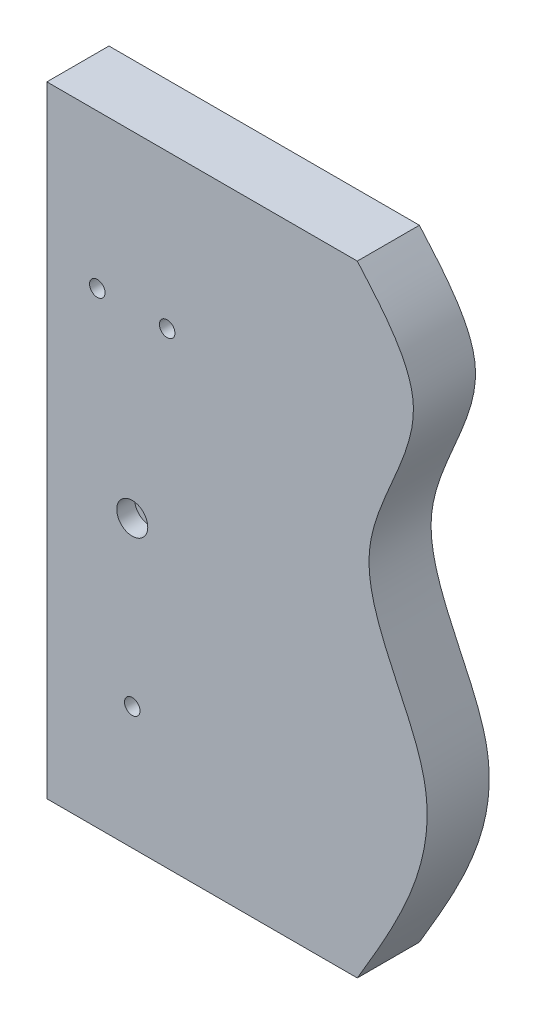
ISO-10303-21;
HEADER;
FILE_DESCRIPTION(('STEP AP214'),'2;1');
FILE_NAME('part.step','',(''),(''),'','','');
FILE_SCHEMA(('AUTOMOTIVE_DESIGN { 1 0 10303 214 1 1 1 1 }'));
ENDSEC;
DATA;
#1=APPLICATION_CONTEXT('core data for automotive mechanical design processes');
#2=APPLICATION_PROTOCOL_DEFINITION('international standard','automotive_design',2000,#1);
#3=PRODUCT_CONTEXT('',#1,'mechanical');
#4=PRODUCT('Part','Part','',(#3));
#5=PRODUCT_RELATED_PRODUCT_CATEGORY('part','',(#4));
#6=PRODUCT_DEFINITION_FORMATION('','',#4);
#7=PRODUCT_DEFINITION_CONTEXT('part definition',#1,'design');
#8=PRODUCT_DEFINITION('design','',#6,#7);
#9=PRODUCT_DEFINITION_SHAPE('','',#8);
#10=(LENGTH_UNIT() NAMED_UNIT(*) SI_UNIT(.MILLI.,.METRE.));
#11=(NAMED_UNIT(*) PLANE_ANGLE_UNIT() SI_UNIT($,.RADIAN.));
#12=(NAMED_UNIT(*) SI_UNIT($,.STERADIAN.) SOLID_ANGLE_UNIT());
#13=UNCERTAINTY_MEASURE_WITH_UNIT(LENGTH_MEASURE(1.E-05),#10,'distance_accuracy_value','');
#14=(GEOMETRIC_REPRESENTATION_CONTEXT(3) GLOBAL_UNCERTAINTY_ASSIGNED_CONTEXT((#13)) GLOBAL_UNIT_ASSIGNED_CONTEXT((#10,
#11,#12)) REPRESENTATION_CONTEXT('',''));
#15=CARTESIAN_POINT('',(0.,0.,0.));
#16=DIRECTION('',(0.,0.,1.));
#17=DIRECTION('',(1.,0.,0.));
#18=AXIS2_PLACEMENT_3D('',#15,#16,#17);
#19=CARTESIAN_POINT('',(-147.,-116.5,-8.5));
#20=DIRECTION('',(0.,-1.,0.));
#21=DIRECTION('',(1.,0.,0.));
#22=AXIS2_PLACEMENT_3D('',#19,#20,#21);
#23=PLANE('',#22);
#24=DIRECTION('',(1.,0.,0.));
#25=VECTOR('',#24,1.);
#26=CARTESIAN_POINT('',(-147.,-116.5,-8.5));
#27=LINE('',#26,#25);
#28=CARTESIAN_POINT('',(-92.8205505282296,-116.5,-8.5));
#29=VERTEX_POINT('',#28);
#30=CARTESIAN_POINT('',(-70.,-116.5,-8.5));
#31=VERTEX_POINT('',#30);
#32=EDGE_CURVE('E141',#29,#31,#27,.T.);
#33=ORIENTED_EDGE('',*,*,#32,.F.);
#34=DIRECTION('',(0.,0.,1.));
#35=VECTOR('',#34,1.);
#36=CARTESIAN_POINT('',(-92.8205505282296,-116.5,-20.));
#37=LINE('',#36,#35);
#38=CARTESIAN_POINT('',(-92.8205505282296,-116.5,8.5));
#39=VERTEX_POINT('',#38);
#40=EDGE_CURVE('E133',#29,#39,#37,.T.);
#41=ORIENTED_EDGE('',*,*,#40,.T.);
#42=DIRECTION('',(1.,0.,0.));
#43=VECTOR('',#42,1.);
#44=CARTESIAN_POINT('',(-147.,-116.5,8.5));
#45=LINE('',#44,#43);
#46=CARTESIAN_POINT('',(-70.,-116.5,8.5));
#47=VERTEX_POINT('',#46);
#48=EDGE_CURVE('E139',#39,#47,#45,.T.);
#49=ORIENTED_EDGE('',*,*,#48,.T.);
#50=DIRECTION('',(0.,0.,1.));
#51=VECTOR('',#50,1.);
#52=CARTESIAN_POINT('',(-70.,-116.5,-8.5));
#53=LINE('',#52,#51);
#54=EDGE_CURVE('E172',#31,#47,#53,.T.);
#55=ORIENTED_EDGE('',*,*,#54,.F.);
#56=EDGE_LOOP('',(#33,#41,#49,#55));
#57=FACE_BOUND('',#56,.T.);
#58=ADVANCED_FACE('F32',(#57),#23,.F.);
#59=CARTESIAN_POINT('',(-147.,-150.,-11.));
#60=DIRECTION('',(-1.,0.,0.));
#61=DIRECTION('',(0.,0.,1.));
#62=AXIS2_PLACEMENT_3D('',#59,#60,#61);
#63=PLANE('',#62);
#64=DIRECTION('',(0.,-1.,0.));
#65=VECTOR('',#64,1.);
#66=CARTESIAN_POINT('',(-147.,80.,-11.));
#67=LINE('',#66,#65);
#68=CARTESIAN_POINT('',(-147.,80.,-11.));
#69=VERTEX_POINT('',#68);
#70=CARTESIAN_POINT('',(-147.,-150.,-11.));
#71=VERTEX_POINT('',#70);
#72=EDGE_CURVE('E174',#69,#71,#67,.T.);
#73=ORIENTED_EDGE('',*,*,#72,.T.);
#74=DIRECTION('',(0.,0.,1.));
#75=VECTOR('',#74,1.);
#76=CARTESIAN_POINT('',(-147.,-150.,-11.));
#77=LINE('',#76,#75);
#78=CARTESIAN_POINT('',(-147.,-150.,11.));
#79=VERTEX_POINT('',#78);
#80=EDGE_CURVE('E177',#71,#79,#77,.T.);
#81=ORIENTED_EDGE('',*,*,#80,.T.);
#82=DIRECTION('',(0.,1.,0.));
#83=VECTOR('',#82,1.);
#84=CARTESIAN_POINT('',(-147.,80.,11.));
#85=LINE('',#84,#83);
#86=CARTESIAN_POINT('',(-147.,80.,11.));
#87=VERTEX_POINT('',#86);
#88=EDGE_CURVE('E181',#79,#87,#85,.T.);
#89=ORIENTED_EDGE('',*,*,#88,.T.);
#90=DIRECTION('',(0.,0.,-1.));
#91=VECTOR('',#90,1.);
#92=CARTESIAN_POINT('',(-147.,80.,-11.));
#93=LINE('',#92,#91);
#94=EDGE_CURVE('E184',#87,#69,#93,.T.);
#95=ORIENTED_EDGE('',*,*,#94,.T.);
#96=EDGE_LOOP('',(#73,#81,#89,#95));
#97=FACE_BOUND('',#96,.T.);
#98=DIRECTION('',(0.,0.,1.));
#99=VECTOR('',#98,1.);
#100=CARTESIAN_POINT('',(-147.,-116.5,-8.5));
#101=LINE('',#100,#99);
#102=CARTESIAN_POINT('',(-147.,-116.5,-8.5));
#103=VERTEX_POINT('',#102);
#104=CARTESIAN_POINT('',(-147.,-116.5,8.5));
#105=VERTEX_POINT('',#104);
#106=EDGE_CURVE('E164',#103,#105,#101,.T.);
#107=ORIENTED_EDGE('',*,*,#106,.F.);
#108=DIRECTION('',(0.,-1.,0.));
#109=VECTOR('',#108,1.);
#110=CARTESIAN_POINT('',(-147.,-116.5,-8.5));
#111=LINE('',#110,#109);
#112=CARTESIAN_POINT('',(-147.,46.5,-8.5));
#113=VERTEX_POINT('',#112);
#114=EDGE_CURVE('E156',#113,#103,#111,.T.);
#115=ORIENTED_EDGE('',*,*,#114,.F.);
#116=DIRECTION('',(0.,0.,1.));
#117=VECTOR('',#116,1.);
#118=CARTESIAN_POINT('',(-147.,46.5,-8.5));
#119=LINE('',#118,#117);
#120=CARTESIAN_POINT('',(-147.,46.5,8.5));
#121=VERTEX_POINT('',#120);
#122=EDGE_CURVE('E167',#113,#121,#119,.T.);
#123=ORIENTED_EDGE('',*,*,#122,.T.);
#124=DIRECTION('',(0.,-1.,0.));
#125=VECTOR('',#124,1.);
#126=CARTESIAN_POINT('',(-147.,-116.5,8.5));
#127=LINE('',#126,#125);
#128=EDGE_CURVE('E161',#121,#105,#127,.T.);
#129=ORIENTED_EDGE('',*,*,#128,.T.);
#130=EDGE_LOOP('',(#107,#115,#123,#129));
#131=FACE_BOUND('',#130,.T.);
#132=ADVANCED_FACE('F235',(#97,#131),#63,.T.);
#133=CARTESIAN_POINT('',(-150.,200.,20.));
#134=DIRECTION('',(1.,0.,0.));
#135=DIRECTION('',(0.,0.,-1.));
#136=AXIS2_PLACEMENT_3D('',#133,#134,#135);
#137=PLANE('',#136);
#138=DIRECTION('',(0.,0.,1.));
#139=VECTOR('',#138,1.);
#140=CARTESIAN_POINT('',(-150.,-150.,-11.));
#141=LINE('',#140,#139);
#142=CARTESIAN_POINT('',(-150.,-150.,-11.));
#143=VERTEX_POINT('',#142);
#144=CARTESIAN_POINT('',(-150.,-150.,11.));
#145=VERTEX_POINT('',#144);
#146=EDGE_CURVE('E189',#143,#145,#141,.T.);
#147=ORIENTED_EDGE('',*,*,#146,.F.);
#148=DIRECTION('',(0.,-1.,0.));
#149=VECTOR('',#148,1.);
#150=CARTESIAN_POINT('',(-150.,80.,-11.));
#151=LINE('',#150,#149);
#152=CARTESIAN_POINT('',(-150.,80.,-11.));
#153=VERTEX_POINT('',#152);
#154=EDGE_CURVE('E166',#153,#143,#151,.T.);
#155=ORIENTED_EDGE('',*,*,#154,.F.);
#156=DIRECTION('',(0.,0.,-1.));
#157=VECTOR('',#156,1.);
#158=CARTESIAN_POINT('',(-150.,80.,-11.));
#159=LINE('',#158,#157);
#160=CARTESIAN_POINT('',(-150.,80.,11.));
#161=VERTEX_POINT('',#160);
#162=EDGE_CURVE('E178',#161,#153,#159,.T.);
#163=ORIENTED_EDGE('',*,*,#162,.F.);
#164=DIRECTION('',(0.,1.,0.));
#165=VECTOR('',#164,1.);
#166=CARTESIAN_POINT('',(-150.,80.,11.));
#167=LINE('',#166,#165);
#168=EDGE_CURVE('E192',#145,#161,#167,.T.);
#169=ORIENTED_EDGE('',*,*,#168,.F.);
#170=EDGE_LOOP('',(#147,#155,#163,#169));
#171=FACE_BOUND('',#170,.T.);
#172=DIRECTION('',(0.,-1.,0.));
#173=VECTOR('',#172,1.);
#174=CARTESIAN_POINT('',(-150.,200.,-20.));
#175=LINE('',#174,#173);
#176=CARTESIAN_POINT('',(-150.,200.,-20.));
#177=VERTEX_POINT('',#176);
#178=CARTESIAN_POINT('',(-150.,-200.,-20.));
#179=VERTEX_POINT('',#178);
#180=EDGE_CURVE('E199',#177,#179,#175,.T.);
#181=ORIENTED_EDGE('',*,*,#180,.T.);
#182=DIRECTION('',(0.,0.,-1.));
#183=VECTOR('',#182,1.);
#184=CARTESIAN_POINT('',(-150.,-200.,20.));
#185=LINE('',#184,#183);
#186=CARTESIAN_POINT('',(-150.,-200.,20.));
#187=VERTEX_POINT('',#186);
#188=EDGE_CURVE('E40',#187,#179,#185,.T.);
#189=ORIENTED_EDGE('',*,*,#188,.F.);
#190=DIRECTION('',(0.,-1.,0.));
#191=VECTOR('',#190,1.);
#192=CARTESIAN_POINT('',(-150.,200.,20.));
#193=LINE('',#192,#191);
#194=CARTESIAN_POINT('',(-150.,200.,20.));
#195=VERTEX_POINT('',#194);
#196=EDGE_CURVE('E206',#195,#187,#193,.T.);
#197=ORIENTED_EDGE('',*,*,#196,.F.);
#198=DIRECTION('',(0.,0.,-1.));
#199=VECTOR('',#198,1.);
#200=CARTESIAN_POINT('',(-150.,200.,20.));
#201=LINE('',#200,#199);
#202=EDGE_CURVE('E430',#195,#177,#201,.T.);
#203=ORIENTED_EDGE('',*,*,#202,.T.);
#204=EDGE_LOOP('',(#181,#189,#197,#203));
#205=FACE_BOUND('',#204,.T.);
#206=ADVANCED_FACE('F34',(#171,#205),#137,.F.);
#207=CARTESIAN_POINT('',(-150.,-200.,20.));
#208=DIRECTION('',(0.,1.,0.));
#209=DIRECTION('',(0.,0.,1.));
#210=AXIS2_PLACEMENT_3D('',#207,#208,#209);
#211=PLANE('',#210);
#212=DIRECTION('',(1.,0.,0.));
#213=VECTOR('',#212,1.);
#214=CARTESIAN_POINT('',(-150.,-200.,-20.));
#215=LINE('',#214,#213);
#216=CARTESIAN_POINT('',(50.,-200.,-20.));
#217=VERTEX_POINT('',#216);
#218=EDGE_CURVE('E419',#179,#217,#215,.T.);
#219=ORIENTED_EDGE('',*,*,#218,.T.);
#220=DIRECTION('',(0.,0.,-1.));
#221=VECTOR('',#220,1.);
#222=CARTESIAN_POINT('',(50.,-200.,20.));
#223=LINE('',#222,#221);
#224=CARTESIAN_POINT('',(50.,-200.,20.));
#225=VERTEX_POINT('',#224);
#226=EDGE_CURVE('E333',#225,#217,#223,.T.);
#227=ORIENTED_EDGE('',*,*,#226,.F.);
#228=DIRECTION('',(1.,0.,0.));
#229=VECTOR('',#228,1.);
#230=CARTESIAN_POINT('',(-150.,-200.,20.));
#231=LINE('',#230,#229);
#232=EDGE_CURVE('E209',#187,#225,#231,.T.);
#233=ORIENTED_EDGE('',*,*,#232,.F.);
#234=ORIENTED_EDGE('',*,*,#188,.T.);
#235=EDGE_LOOP('',(#219,#227,#233,#234));
#236=FACE_BOUND('',#235,.T.);
#237=ADVANCED_FACE('F227',(#236),#211,.F.);
#238=CARTESIAN_POINT('',(50.,-200.,20.));
#239=CARTESIAN_POINT('',(75.8926121429316,-156.299492504264,20.));
#240=CARTESIAN_POINT('',(123.473848535243,-75.9937988901806,20.));
#241=CARTESIAN_POINT('',(27.2782564010871,35.2365570661427,20.));
#242=CARTESIAN_POINT('',(108.79400955081,132.296562906832,20.));
#243=CARTESIAN_POINT('',(66.8795606617927,180.562572919298,20.));
#244=CARTESIAN_POINT('',(50.,200.,20.));
#245=B_SPLINE_CURVE_WITH_KNOTS('',3,(#238,#239,#240,#241,#242,#243,#244),.UNSPECIFIED.,.F.,.F.,
(4,1,1,1,4),(0.,0.322833315670229,0.593250623900925,0.836196086314051,1.),.UNSPECIFIED.);
#246=DIRECTION('',(0.,0.,-1.));
#247=VECTOR('',#246,1.);
#248=SURFACE_OF_LINEAR_EXTRUSION('',#245,#247);
#249=CARTESIAN_POINT('',(50.,-200.,-20.));
#250=CARTESIAN_POINT('',(75.8926121429316,-156.299492504264,-20.));
#251=CARTESIAN_POINT('',(123.473848535243,-75.9937988901806,-20.));
#252=CARTESIAN_POINT('',(27.2782564010871,35.2365570661427,-20.));
#253=CARTESIAN_POINT('',(108.79400955081,132.296562906832,-20.));
#254=CARTESIAN_POINT('',(66.8795606617927,180.562572919298,-20.));
#255=CARTESIAN_POINT('',(50.,200.,-20.));
#256=B_SPLINE_CURVE_WITH_KNOTS('',3,(#249,#250,#251,#252,#253,#254,#255),.UNSPECIFIED.,.F.,.F.,
(4,1,1,1,4),(0.,0.322833315670229,0.593250623900925,0.836196086314051,1.),.UNSPECIFIED.);
#257=CARTESIAN_POINT('',(50.,200.,-20.));
#258=VERTEX_POINT('',#257);
#259=EDGE_CURVE('E420',#217,#258,#256,.T.);
#260=ORIENTED_EDGE('',*,*,#259,.T.);
#261=DIRECTION('',(0.,0.,-1.));
#262=VECTOR('',#261,1.);
#263=CARTESIAN_POINT('',(50.,200.,20.));
#264=LINE('',#263,#262);
#265=CARTESIAN_POINT('',(50.,200.,20.));
#266=VERTEX_POINT('',#265);
#267=EDGE_CURVE('E336',#266,#258,#264,.T.);
#268=ORIENTED_EDGE('',*,*,#267,.F.);
#269=EDGE_CURVE('E212',#225,#266,#245,.T.);
#270=ORIENTED_EDGE('',*,*,#269,.F.);
#271=ORIENTED_EDGE('',*,*,#226,.T.);
#272=EDGE_LOOP('',(#260,#268,#270,#271));
#273=FACE_BOUND('',#272,.T.);
#274=ADVANCED_FACE('F223',(#273),#248,.F.);
#275=CARTESIAN_POINT('',(-150.,200.,20.));
#276=DIRECTION('',(0.,-1.,0.));
#277=DIRECTION('',(0.,0.,-1.));
#278=AXIS2_PLACEMENT_3D('',#275,#276,#277);
#279=PLANE('',#278);
#280=DIRECTION('',(-1.,0.,0.));
#281=VECTOR('',#280,1.);
#282=CARTESIAN_POINT('',(-150.,200.,-20.));
#283=LINE('',#282,#281);
#284=EDGE_CURVE('E210',#258,#177,#283,.T.);
#285=ORIENTED_EDGE('',*,*,#284,.T.);
#286=ORIENTED_EDGE('',*,*,#202,.F.);
#287=DIRECTION('',(-1.,0.,0.));
#288=VECTOR('',#287,1.);
#289=CARTESIAN_POINT('',(-150.,200.,20.));
#290=LINE('',#289,#288);
#291=EDGE_CURVE('E217',#266,#195,#290,.T.);
#292=ORIENTED_EDGE('',*,*,#291,.F.);
#293=ORIENTED_EDGE('',*,*,#267,.T.);
#294=EDGE_LOOP('',(#285,#286,#292,#293));
#295=FACE_BOUND('',#294,.T.);
#296=ADVANCED_FACE('F226',(#295),#279,.F.);
#297=CARTESIAN_POINT('',(64.7438582512238,2.07966306238669,20.));
#298=DIRECTION('',(0.,0.,1.));
#299=DIRECTION('',(1.,0.,0.));
#300=AXIS2_PLACEMENT_3D('',#297,#298,#299);
#301=PLANE('',#300);
#302=CARTESIAN_POINT('',(-72.5,101.,20.));
#303=DIRECTION('',(0.,0.,1.));
#304=DIRECTION('',(1.,0.,0.));
#305=AXIS2_PLACEMENT_3D('',#302,#303,#304);
#306=CIRCLE('',#305,5.00000000000001);
#307=CARTESIAN_POINT('',(-67.5,101.,20.));
#308=VERTEX_POINT('',#307);
#309=EDGE_CURVE('E298',#308,#308,#306,.T.);
#310=ORIENTED_EDGE('',*,*,#309,.F.);
#311=EDGE_LOOP('',(#310));
#312=FACE_BOUND('',#311,.T.);
#313=CARTESIAN_POINT('',(-95.,-121.,20.));
#314=DIRECTION('',(0.,0.,1.));
#315=DIRECTION('',(1.,0.,0.));
#316=AXIS2_PLACEMENT_3D('',#313,#314,#315);
#317=CIRCLE('',#316,5.00000000000001);
#318=CARTESIAN_POINT('',(-90.,-121.,20.));
#319=VERTEX_POINT('',#318);
#320=EDGE_CURVE('E292',#319,#319,#317,.T.);
#321=ORIENTED_EDGE('',*,*,#320,.F.);
#322=EDGE_LOOP('',(#321));
#323=FACE_BOUND('',#322,.T.);
#324=CARTESIAN_POINT('',(-117.5,101.,20.));
#325=DIRECTION('',(0.,0.,1.));
#326=DIRECTION('',(1.,0.,0.));
#327=AXIS2_PLACEMENT_3D('',#324,#325,#326);
#328=CIRCLE('',#327,5.00000000000001);
#329=CARTESIAN_POINT('',(-112.5,101.,20.));
#330=VERTEX_POINT('',#329);
#331=EDGE_CURVE('E284',#330,#330,#328,.T.);
#332=ORIENTED_EDGE('',*,*,#331,.F.);
#333=EDGE_LOOP('',(#332));
#334=FACE_BOUND('',#333,.T.);
#335=CARTESIAN_POINT('',(-95.,-16.,20.));
#336=DIRECTION('',(0.,0.,1.));
#337=DIRECTION('',(1.,0.,0.));
#338=AXIS2_PLACEMENT_3D('',#335,#336,#337);
#339=CIRCLE('',#338,9.99999999999999);
#340=CARTESIAN_POINT('',(-85.,-16.,20.));
#341=VERTEX_POINT('',#340);
#342=EDGE_CURVE('E277',#341,#341,#339,.T.);
#343=ORIENTED_EDGE('',*,*,#342,.F.);
#344=EDGE_LOOP('',(#343));
#345=FACE_BOUND('',#344,.T.);
#346=ORIENTED_EDGE('',*,*,#196,.T.);
#347=ORIENTED_EDGE('',*,*,#232,.T.);
#348=ORIENTED_EDGE('',*,*,#269,.T.);
#349=ORIENTED_EDGE('',*,*,#291,.T.);
#350=EDGE_LOOP('',(#346,#347,#348,#349));
#351=FACE_BOUND('',#350,.T.);
#352=ADVANCED_FACE('F313',(#312,#323,#334,#345,#351),#301,.T.);
#353=CARTESIAN_POINT('',(64.7438582512238,2.07966306238669,-20.));
#354=DIRECTION('',(0.,0.,1.));
#355=DIRECTION('',(1.,0.,0.));
#356=AXIS2_PLACEMENT_3D('',#353,#354,#355);
#357=PLANE('',#356);
#358=CARTESIAN_POINT('',(-72.5,101.,-20.));
#359=DIRECTION('',(0.,0.,1.));
#360=DIRECTION('',(1.,0.,0.));
#361=AXIS2_PLACEMENT_3D('',#358,#359,#360);
#362=CIRCLE('',#361,5.00000000000001);
#363=CARTESIAN_POINT('',(-67.5,101.,-20.));
#364=VERTEX_POINT('',#363);
#365=EDGE_CURVE('E295',#364,#364,#362,.T.);
#366=ORIENTED_EDGE('',*,*,#365,.T.);
#367=EDGE_LOOP('',(#366));
#368=FACE_BOUND('',#367,.T.);
#369=CARTESIAN_POINT('',(-95.,-121.,-20.));
#370=DIRECTION('',(0.,0.,1.));
#371=DIRECTION('',(1.,0.,0.));
#372=AXIS2_PLACEMENT_3D('',#369,#370,#371);
#373=CIRCLE('',#372,5.00000000000001);
#374=CARTESIAN_POINT('',(-90.,-121.,-20.));
#375=VERTEX_POINT('',#374);
#376=EDGE_CURVE('E291',#375,#375,#373,.T.);
#377=ORIENTED_EDGE('',*,*,#376,.T.);
#378=EDGE_LOOP('',(#377));
#379=FACE_BOUND('',#378,.T.);
#380=CARTESIAN_POINT('',(-117.5,101.,-20.));
#381=DIRECTION('',(0.,0.,1.));
#382=DIRECTION('',(1.,0.,0.));
#383=AXIS2_PLACEMENT_3D('',#380,#381,#382);
#384=CIRCLE('',#383,5.00000000000001);
#385=CARTESIAN_POINT('',(-112.5,101.,-20.));
#386=VERTEX_POINT('',#385);
#387=EDGE_CURVE('E281',#386,#386,#384,.T.);
#388=ORIENTED_EDGE('',*,*,#387,.T.);
#389=EDGE_LOOP('',(#388));
#390=FACE_BOUND('',#389,.T.);
#391=CARTESIAN_POINT('',(-95.,-16.,-20.));
#392=DIRECTION('',(0.,0.,1.));
#393=DIRECTION('',(1.,0.,0.));
#394=AXIS2_PLACEMENT_3D('',#391,#392,#393);
#395=CIRCLE('',#394,9.99999999999999);
#396=CARTESIAN_POINT('',(-85.,-16.,-20.));
#397=VERTEX_POINT('',#396);
#398=EDGE_CURVE('E280',#397,#397,#395,.T.);
#399=ORIENTED_EDGE('',*,*,#398,.T.);
#400=EDGE_LOOP('',(#399));
#401=FACE_BOUND('',#400,.T.);
#402=ORIENTED_EDGE('',*,*,#180,.F.);
#403=ORIENTED_EDGE('',*,*,#284,.F.);
#404=ORIENTED_EDGE('',*,*,#259,.F.);
#405=ORIENTED_EDGE('',*,*,#218,.F.);
#406=EDGE_LOOP('',(#402,#403,#404,#405));
#407=FACE_BOUND('',#406,.T.);
#408=ADVANCED_FACE('F304',(#368,#379,#390,#401,#407),#357,.F.);
#409=CARTESIAN_POINT('',(-147.,80.,-11.));
#410=DIRECTION('',(0.,0.,-1.));
#411=DIRECTION('',(0.,1.,0.));
#412=AXIS2_PLACEMENT_3D('',#409,#410,#411);
#413=PLANE('',#412);
#414=ORIENTED_EDGE('',*,*,#154,.T.);
#415=DIRECTION('',(-1.,0.,0.));
#416=VECTOR('',#415,1.);
#417=CARTESIAN_POINT('',(-147.,-150.,-11.));
#418=LINE('',#417,#416);
#419=EDGE_CURVE('E187',#71,#143,#418,.T.);
#420=ORIENTED_EDGE('',*,*,#419,.F.);
#421=ORIENTED_EDGE('',*,*,#72,.F.);
#422=DIRECTION('',(-1.,0.,0.));
#423=VECTOR('',#422,1.);
#424=CARTESIAN_POINT('',(-147.,80.,-11.));
#425=LINE('',#424,#423);
#426=EDGE_CURVE('E197',#69,#153,#425,.T.);
#427=ORIENTED_EDGE('',*,*,#426,.T.);
#428=EDGE_LOOP('',(#414,#420,#421,#427));
#429=FACE_BOUND('',#428,.T.);
#430=ADVANCED_FACE('F414',(#429),#413,.F.);
#431=CARTESIAN_POINT('',(-147.,80.,-11.));
#432=DIRECTION('',(0.,1.,0.));
#433=DIRECTION('',(-1.,0.,0.));
#434=AXIS2_PLACEMENT_3D('',#431,#432,#433);
#435=PLANE('',#434);
#436=ORIENTED_EDGE('',*,*,#162,.T.);
#437=ORIENTED_EDGE('',*,*,#426,.F.);
#438=ORIENTED_EDGE('',*,*,#94,.F.);
#439=DIRECTION('',(-1.,0.,0.));
#440=VECTOR('',#439,1.);
#441=CARTESIAN_POINT('',(-147.,80.,11.));
#442=LINE('',#441,#440);
#443=EDGE_CURVE('E200',#87,#161,#442,.T.);
#444=ORIENTED_EDGE('',*,*,#443,.T.);
#445=EDGE_LOOP('',(#436,#437,#438,#444));
#446=FACE_BOUND('',#445,.T.);
#447=ADVANCED_FACE('F455',(#446),#435,.F.);
#448=CARTESIAN_POINT('',(-147.,80.,11.));
#449=DIRECTION('',(0.,0.,1.));
#450=DIRECTION('',(0.,-1.,0.));
#451=AXIS2_PLACEMENT_3D('',#448,#449,#450);
#452=PLANE('',#451);
#453=ORIENTED_EDGE('',*,*,#168,.T.);
#454=ORIENTED_EDGE('',*,*,#443,.F.);
#455=ORIENTED_EDGE('',*,*,#88,.F.);
#456=DIRECTION('',(-1.,0.,0.));
#457=VECTOR('',#456,1.);
#458=CARTESIAN_POINT('',(-147.,-150.,11.));
#459=LINE('',#458,#457);
#460=EDGE_CURVE('E202',#79,#145,#459,.T.);
#461=ORIENTED_EDGE('',*,*,#460,.T.);
#462=EDGE_LOOP('',(#453,#454,#455,#461));
#463=FACE_BOUND('',#462,.T.);
#464=ADVANCED_FACE('F257',(#463),#452,.F.);
#465=CARTESIAN_POINT('',(-147.,-150.,-11.));
#466=DIRECTION('',(0.,-1.,0.));
#467=DIRECTION('',(1.,0.,0.));
#468=AXIS2_PLACEMENT_3D('',#465,#466,#467);
#469=PLANE('',#468);
#470=ORIENTED_EDGE('',*,*,#146,.T.);
#471=ORIENTED_EDGE('',*,*,#460,.F.);
#472=ORIENTED_EDGE('',*,*,#80,.F.);
#473=ORIENTED_EDGE('',*,*,#419,.T.);
#474=EDGE_LOOP('',(#470,#471,#472,#473));
#475=FACE_BOUND('',#474,.T.);
#476=ADVANCED_FACE('F248',(#475),#469,.F.);
#477=CARTESIAN_POINT('',(-97.1794494717704,-116.5,8.5));
#478=VERTEX_POINT('',#477);
#479=EDGE_CURVE('E53',#105,#478,#45,.T.);
#480=ORIENTED_EDGE('',*,*,#479,.T.);
#481=DIRECTION('',(0.,0.,1.));
#482=VECTOR('',#481,1.);
#483=CARTESIAN_POINT('',(-97.1794494717704,-116.5,-20.));
#484=LINE('',#483,#482);
#485=CARTESIAN_POINT('',(-97.1794494717704,-116.5,-8.5));
#486=VERTEX_POINT('',#485);
#487=EDGE_CURVE('E47',#478,#486,#484,.F.);
#488=ORIENTED_EDGE('',*,*,#487,.T.);
#489=EDGE_CURVE('E262',#103,#486,#27,.T.);
#490=ORIENTED_EDGE('',*,*,#489,.F.);
#491=ORIENTED_EDGE('',*,*,#106,.T.);
#492=EDGE_LOOP('',(#480,#488,#490,#491));
#493=FACE_BOUND('',#492,.T.);
#494=ADVANCED_FACE('F239',(#493),#23,.F.);
#495=CARTESIAN_POINT('',(-147.,46.5,-8.5));
#496=DIRECTION('',(0.,1.,0.));
#497=DIRECTION('',(-1.,0.,0.));
#498=AXIS2_PLACEMENT_3D('',#495,#496,#497);
#499=PLANE('',#498);
#500=DIRECTION('',(-1.,0.,0.));
#501=VECTOR('',#500,1.);
#502=CARTESIAN_POINT('',(-147.,46.5,8.5));
#503=LINE('',#502,#501);
#504=CARTESIAN_POINT('',(-70.,46.5,8.5));
#505=VERTEX_POINT('',#504);
#506=EDGE_CURVE('E159',#505,#121,#503,.T.);
#507=ORIENTED_EDGE('',*,*,#506,.T.);
#508=ORIENTED_EDGE('',*,*,#122,.F.);
#509=DIRECTION('',(-1.,0.,0.));
#510=VECTOR('',#509,1.);
#511=CARTESIAN_POINT('',(-147.,46.5,-8.5));
#512=LINE('',#511,#510);
#513=CARTESIAN_POINT('',(-70.,46.5,-8.5));
#514=VERTEX_POINT('',#513);
#515=EDGE_CURVE('E273',#514,#113,#512,.T.);
#516=ORIENTED_EDGE('',*,*,#515,.F.);
#517=DIRECTION('',(0.,0.,1.));
#518=VECTOR('',#517,1.);
#519=CARTESIAN_POINT('',(-70.,46.5,-8.5));
#520=LINE('',#519,#518);
#521=EDGE_CURVE('E170',#514,#505,#520,.T.);
#522=ORIENTED_EDGE('',*,*,#521,.T.);
#523=EDGE_LOOP('',(#507,#508,#516,#522));
#524=FACE_BOUND('',#523,.T.);
#525=ADVANCED_FACE('F247',(#524),#499,.F.);
#526=CARTESIAN_POINT('',(-70.,-116.5,-8.5));
#527=DIRECTION('',(1.,0.,0.));
#528=DIRECTION('',(0.,0.,-1.));
#529=AXIS2_PLACEMENT_3D('',#526,#527,#528);
#530=PLANE('',#529);
#531=DIRECTION('',(0.,1.,0.));
#532=VECTOR('',#531,1.);
#533=CARTESIAN_POINT('',(-70.,-116.5,8.5));
#534=LINE('',#533,#532);
#535=EDGE_CURVE('E148',#47,#505,#534,.T.);
#536=ORIENTED_EDGE('',*,*,#535,.T.);
#537=ORIENTED_EDGE('',*,*,#521,.F.);
#538=DIRECTION('',(0.,1.,0.));
#539=VECTOR('',#538,1.);
#540=CARTESIAN_POINT('',(-70.,-116.5,-8.5));
#541=LINE('',#540,#539);
#542=EDGE_CURVE('E270',#31,#514,#541,.T.);
#543=ORIENTED_EDGE('',*,*,#542,.F.);
#544=ORIENTED_EDGE('',*,*,#54,.T.);
#545=EDGE_LOOP('',(#536,#537,#543,#544));
#546=FACE_BOUND('',#545,.T.);
#547=ADVANCED_FACE('F254',(#546),#530,.F.);
#548=CARTESIAN_POINT('',(-70.,-116.5,-8.5));
#549=DIRECTION('',(0.,0.,1.));
#550=DIRECTION('',(1.,0.,0.));
#551=AXIS2_PLACEMENT_3D('',#548,#549,#550);
#552=PLANE('',#551);
#553=CARTESIAN_POINT('',(-95.,-121.,-8.5));
#554=DIRECTION('',(0.,0.,1.));
#555=DIRECTION('',(1.,0.,0.));
#556=AXIS2_PLACEMENT_3D('',#553,#554,#555);
#557=CIRCLE('',#556,5.00000000000001);
#558=EDGE_CURVE('E142',#29,#486,#557,.T.);
#559=ORIENTED_EDGE('',*,*,#558,.F.);
#560=ORIENTED_EDGE('',*,*,#32,.T.);
#561=ORIENTED_EDGE('',*,*,#542,.T.);
#562=ORIENTED_EDGE('',*,*,#515,.T.);
#563=ORIENTED_EDGE('',*,*,#114,.T.);
#564=ORIENTED_EDGE('',*,*,#489,.T.);
#565=EDGE_LOOP('',(#559,#560,#561,#562,#563,#564));
#566=FACE_BOUND('',#565,.T.);
#567=CARTESIAN_POINT('',(-95.,-16.,-8.5));
#568=DIRECTION('',(0.,0.,1.));
#569=DIRECTION('',(1.,0.,0.));
#570=AXIS2_PLACEMENT_3D('',#567,#568,#569);
#571=CIRCLE('',#570,9.99999999999999);
#572=CARTESIAN_POINT('',(-85.,-16.,-8.5));
#573=VERTEX_POINT('',#572);
#574=EDGE_CURVE('E149',#573,#573,#571,.T.);
#575=ORIENTED_EDGE('',*,*,#574,.F.);
#576=EDGE_LOOP('',(#575));
#577=FACE_BOUND('',#576,.T.);
#578=ADVANCED_FACE('F354',(#566,#577),#552,.T.);
#579=CARTESIAN_POINT('',(-70.,-116.5,8.5));
#580=DIRECTION('',(0.,0.,1.));
#581=DIRECTION('',(1.,0.,0.));
#582=AXIS2_PLACEMENT_3D('',#579,#580,#581);
#583=PLANE('',#582);
#584=CARTESIAN_POINT('',(-95.,-16.,8.5));
#585=DIRECTION('',(0.,0.,1.));
#586=DIRECTION('',(1.,0.,0.));
#587=AXIS2_PLACEMENT_3D('',#584,#585,#586);
#588=CIRCLE('',#587,9.99999999999999);
#589=CARTESIAN_POINT('',(-85.,-16.,8.5));
#590=VERTEX_POINT('',#589);
#591=EDGE_CURVE('E152',#590,#590,#588,.T.);
#592=ORIENTED_EDGE('',*,*,#591,.T.);
#593=EDGE_LOOP('',(#592));
#594=FACE_BOUND('',#593,.T.);
#595=ORIENTED_EDGE('',*,*,#48,.F.);
#596=CARTESIAN_POINT('',(-95.,-121.,8.5));
#597=DIRECTION('',(0.,0.,1.));
#598=DIRECTION('',(1.,0.,0.));
#599=AXIS2_PLACEMENT_3D('',#596,#597,#598);
#600=CIRCLE('',#599,5.00000000000001);
#601=EDGE_CURVE('E11',#39,#478,#600,.T.);
#602=ORIENTED_EDGE('',*,*,#601,.T.);
#603=ORIENTED_EDGE('',*,*,#479,.F.);
#604=ORIENTED_EDGE('',*,*,#128,.F.);
#605=ORIENTED_EDGE('',*,*,#506,.F.);
#606=ORIENTED_EDGE('',*,*,#535,.F.);
#607=EDGE_LOOP('',(#595,#602,#603,#604,#605,#606));
#608=FACE_BOUND('',#607,.T.);
#609=ADVANCED_FACE('F145',(#594,#608),#583,.F.);
#610=CARTESIAN_POINT('',(-95.,-16.,-20.));
#611=DIRECTION('',(0.,0.,1.));
#612=DIRECTION('',(1.,0.,0.));
#613=AXIS2_PLACEMENT_3D('',#610,#611,#612);
#614=CYLINDRICAL_SURFACE('',#613,9.99999999999999);
#615=ORIENTED_EDGE('',*,*,#342,.T.);
#616=EDGE_LOOP('',(#615));
#617=FACE_BOUND('',#616,.T.);
#618=ORIENTED_EDGE('',*,*,#591,.F.);
#619=EDGE_LOOP('',(#618));
#620=FACE_BOUND('',#619,.T.);
#621=ADVANCED_FACE('F343',(#617,#620),#614,.F.);
#622=ORIENTED_EDGE('',*,*,#574,.T.);
#623=EDGE_LOOP('',(#622));
#624=FACE_BOUND('',#623,.T.);
#625=ORIENTED_EDGE('',*,*,#398,.F.);
#626=EDGE_LOOP('',(#625));
#627=FACE_BOUND('',#626,.T.);
#628=ADVANCED_FACE('F345',(#624,#627),#614,.F.);
#629=CARTESIAN_POINT('',(-117.5,101.,-20.));
#630=DIRECTION('',(0.,0.,1.));
#631=DIRECTION('',(1.,0.,0.));
#632=AXIS2_PLACEMENT_3D('',#629,#630,#631);
#633=CYLINDRICAL_SURFACE('',#632,5.00000000000001);
#634=ORIENTED_EDGE('',*,*,#387,.F.);
#635=EDGE_LOOP('',(#634));
#636=FACE_BOUND('',#635,.T.);
#637=ORIENTED_EDGE('',*,*,#331,.T.);
#638=EDGE_LOOP('',(#637));
#639=FACE_BOUND('',#638,.T.);
#640=ADVANCED_FACE('F352',(#636,#639),#633,.F.);
#641=CARTESIAN_POINT('',(-95.,-121.,-20.));
#642=DIRECTION('',(0.,0.,1.));
#643=DIRECTION('',(1.,0.,0.));
#644=AXIS2_PLACEMENT_3D('',#641,#642,#643);
#645=CYLINDRICAL_SURFACE('',#644,5.00000000000001);
#646=ORIENTED_EDGE('',*,*,#558,.T.);
#647=ORIENTED_EDGE('',*,*,#487,.F.);
#648=ORIENTED_EDGE('',*,*,#601,.F.);
#649=ORIENTED_EDGE('',*,*,#40,.F.);
#650=EDGE_LOOP('',(#646,#647,#648,#649));
#651=FACE_BOUND('',#650,.T.);
#652=ORIENTED_EDGE('',*,*,#376,.F.);
#653=EDGE_LOOP('',(#652));
#654=FACE_BOUND('',#653,.T.);
#655=ORIENTED_EDGE('',*,*,#320,.T.);
#656=EDGE_LOOP('',(#655));
#657=FACE_BOUND('',#656,.T.);
#658=ADVANCED_FACE('F131',(#651,#654,#657),#645,.F.);
#659=CARTESIAN_POINT('',(-72.5,101.,-20.));
#660=DIRECTION('',(0.,0.,1.));
#661=DIRECTION('',(1.,0.,0.));
#662=AXIS2_PLACEMENT_3D('',#659,#660,#661);
#663=CYLINDRICAL_SURFACE('',#662,5.00000000000001);
#664=ORIENTED_EDGE('',*,*,#365,.F.);
#665=EDGE_LOOP('',(#664));
#666=FACE_BOUND('',#665,.T.);
#667=ORIENTED_EDGE('',*,*,#309,.T.);
#668=EDGE_LOOP('',(#667));
#669=FACE_BOUND('',#668,.T.);
#670=ADVANCED_FACE('F307',(#666,#669),#663,.F.);
#671=CLOSED_SHELL('',(#58,#132,#206,#237,#274,#296,#352,#408,#430,#447,#464,#476,#494,#525,#547,
#578,#609,#621,#628,#640,#658,#670));
#672=MANIFOLD_SOLID_BREP('B2',#671);
#673=ADVANCED_BREP_SHAPE_REPRESENTATION('',(#18,#672),#14);
#674=SHAPE_DEFINITION_REPRESENTATION(#9,#673);
ENDSEC;
END-ISO-10303-21;
